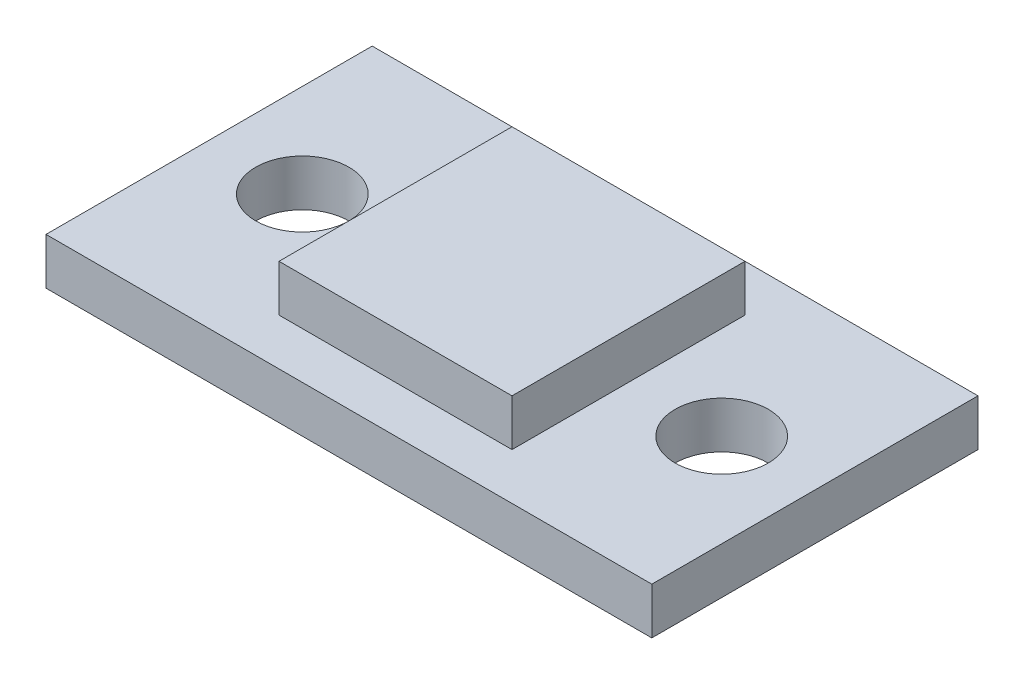
ISO-10303-21;
HEADER;
FILE_DESCRIPTION(('STEP AP214'),'2;1');
FILE_NAME('part.step','',(''),(''),'','','');
FILE_SCHEMA(('AUTOMOTIVE_DESIGN { 1 0 10303 214 1 1 1 1 }'));
ENDSEC;
DATA;
#1=APPLICATION_CONTEXT('core data for automotive mechanical design processes');
#2=APPLICATION_PROTOCOL_DEFINITION('international standard','automotive_design',2000,#1);
#3=PRODUCT_CONTEXT('',#1,'mechanical');
#4=PRODUCT('Part','Part','',(#3));
#5=PRODUCT_RELATED_PRODUCT_CATEGORY('part','',(#4));
#6=PRODUCT_DEFINITION_FORMATION('','',#4);
#7=PRODUCT_DEFINITION_CONTEXT('part definition',#1,'design');
#8=PRODUCT_DEFINITION('design','',#6,#7);
#9=PRODUCT_DEFINITION_SHAPE('','',#8);
#10=(LENGTH_UNIT() NAMED_UNIT(*) SI_UNIT(.MILLI.,.METRE.));
#11=(NAMED_UNIT(*) PLANE_ANGLE_UNIT() SI_UNIT($,.RADIAN.));
#12=(NAMED_UNIT(*) SI_UNIT($,.STERADIAN.) SOLID_ANGLE_UNIT());
#13=UNCERTAINTY_MEASURE_WITH_UNIT(LENGTH_MEASURE(1.E-05),#10,'distance_accuracy_value','');
#14=(GEOMETRIC_REPRESENTATION_CONTEXT(3) GLOBAL_UNCERTAINTY_ASSIGNED_CONTEXT((#13)) GLOBAL_UNIT_ASSIGNED_CONTEXT((#10,
#11,#12)) REPRESENTATION_CONTEXT('',''));
#15=CARTESIAN_POINT('',(0.,0.,0.));
#16=DIRECTION('',(0.,0.,1.));
#17=DIRECTION('',(1.,0.,0.));
#18=AXIS2_PLACEMENT_3D('',#15,#16,#17);
#19=CARTESIAN_POINT('',(-2.5,1.,-2.5));
#20=DIRECTION('',(1.,0.,0.));
#21=DIRECTION('',(0.,0.,-1.));
#22=AXIS2_PLACEMENT_3D('',#19,#20,#21);
#23=PLANE('',#22);
#24=DIRECTION('',(0.,0.,1.));
#25=VECTOR('',#24,1.);
#26=CARTESIAN_POINT('',(-2.5,0.,-2.5));
#27=LINE('',#26,#25);
#28=CARTESIAN_POINT('',(-2.5,0.,-2.5));
#29=VERTEX_POINT('',#28);
#30=CARTESIAN_POINT('',(-2.5,0.,2.5));
#31=VERTEX_POINT('',#30);
#32=EDGE_CURVE('E119',#29,#31,#27,.T.);
#33=ORIENTED_EDGE('',*,*,#32,.T.);
#34=DIRECTION('',(0.,-1.,0.));
#35=VECTOR('',#34,1.);
#36=CARTESIAN_POINT('',(-2.5,1.,2.5));
#37=LINE('',#36,#35);
#38=CARTESIAN_POINT('',(-2.5,1.,2.5));
#39=VERTEX_POINT('',#38);
#40=EDGE_CURVE('E11',#39,#31,#37,.T.);
#41=ORIENTED_EDGE('',*,*,#40,.F.);
#42=DIRECTION('',(0.,0.,1.));
#43=VECTOR('',#42,1.);
#44=CARTESIAN_POINT('',(-2.5,1.,-2.5));
#45=LINE('',#44,#43);
#46=CARTESIAN_POINT('',(-2.5,1.,-2.5));
#47=VERTEX_POINT('',#46);
#48=EDGE_CURVE('E128',#47,#39,#45,.T.);
#49=ORIENTED_EDGE('',*,*,#48,.F.);
#50=DIRECTION('',(0.,-1.,0.));
#51=VECTOR('',#50,1.);
#52=CARTESIAN_POINT('',(-2.5,1.,-2.5));
#53=LINE('',#52,#51);
#54=EDGE_CURVE('E135',#47,#29,#53,.T.);
#55=ORIENTED_EDGE('',*,*,#54,.T.);
#56=EDGE_LOOP('',(#33,#41,#49,#55));
#57=FACE_BOUND('',#56,.T.);
#58=ADVANCED_FACE('F33',(#57),#23,.F.);
#59=CARTESIAN_POINT('',(-2.5,1.,2.5));
#60=DIRECTION('',(0.,0.,-1.));
#61=DIRECTION('',(-1.,0.,0.));
#62=AXIS2_PLACEMENT_3D('',#59,#60,#61);
#63=PLANE('',#62);
#64=DIRECTION('',(1.,0.,0.));
#65=VECTOR('',#64,1.);
#66=CARTESIAN_POINT('',(-2.5,0.,2.5));
#67=LINE('',#66,#65);
#68=CARTESIAN_POINT('',(2.5,0.,2.5));
#69=VERTEX_POINT('',#68);
#70=EDGE_CURVE('E122',#31,#69,#67,.T.);
#71=ORIENTED_EDGE('',*,*,#70,.T.);
#72=DIRECTION('',(0.,-1.,0.));
#73=VECTOR('',#72,1.);
#74=CARTESIAN_POINT('',(2.5,1.,2.5));
#75=LINE('',#74,#73);
#76=CARTESIAN_POINT('',(2.5,1.,2.5));
#77=VERTEX_POINT('',#76);
#78=EDGE_CURVE('E41',#77,#69,#75,.T.);
#79=ORIENTED_EDGE('',*,*,#78,.F.);
#80=DIRECTION('',(1.,0.,0.));
#81=VECTOR('',#80,1.);
#82=CARTESIAN_POINT('',(-2.5,1.,2.5));
#83=LINE('',#82,#81);
#84=EDGE_CURVE('E130',#39,#77,#83,.T.);
#85=ORIENTED_EDGE('',*,*,#84,.F.);
#86=ORIENTED_EDGE('',*,*,#40,.T.);
#87=EDGE_LOOP('',(#71,#79,#85,#86));
#88=FACE_BOUND('',#87,.T.);
#89=ADVANCED_FACE('F155',(#88),#63,.F.);
#90=CARTESIAN_POINT('',(2.5,1.,-2.5));
#91=DIRECTION('',(-1.,0.,0.));
#92=DIRECTION('',(0.,0.,1.));
#93=AXIS2_PLACEMENT_3D('',#90,#91,#92);
#94=PLANE('',#93);
#95=DIRECTION('',(0.,0.,-1.));
#96=VECTOR('',#95,1.);
#97=CARTESIAN_POINT('',(2.5,0.,-2.5));
#98=LINE('',#97,#96);
#99=CARTESIAN_POINT('',(2.5,0.,-2.5));
#100=VERTEX_POINT('',#99);
#101=EDGE_CURVE('E139',#69,#100,#98,.T.);
#102=ORIENTED_EDGE('',*,*,#101,.T.);
#103=DIRECTION('',(0.,-1.,0.));
#104=VECTOR('',#103,1.);
#105=CARTESIAN_POINT('',(2.5,1.,-2.5));
#106=LINE('',#105,#104);
#107=CARTESIAN_POINT('',(2.5,1.,-2.5));
#108=VERTEX_POINT('',#107);
#109=EDGE_CURVE('E146',#108,#100,#106,.T.);
#110=ORIENTED_EDGE('',*,*,#109,.F.);
#111=DIRECTION('',(0.,0.,-1.));
#112=VECTOR('',#111,1.);
#113=CARTESIAN_POINT('',(2.5,1.,-2.5));
#114=LINE('',#113,#112);
#115=EDGE_CURVE('E133',#77,#108,#114,.T.);
#116=ORIENTED_EDGE('',*,*,#115,.F.);
#117=ORIENTED_EDGE('',*,*,#78,.T.);
#118=EDGE_LOOP('',(#102,#110,#116,#117));
#119=FACE_BOUND('',#118,.T.);
#120=ADVANCED_FACE('F152',(#119),#94,.F.);
#121=CARTESIAN_POINT('',(-2.5,1.,-2.5));
#122=DIRECTION('',(0.,0.,1.));
#123=DIRECTION('',(1.,0.,0.));
#124=AXIS2_PLACEMENT_3D('',#121,#122,#123);
#125=PLANE('',#124);
#126=DIRECTION('',(-1.,0.,0.));
#127=VECTOR('',#126,1.);
#128=CARTESIAN_POINT('',(-2.5,0.,-2.5));
#129=LINE('',#128,#127);
#130=EDGE_CURVE('E131',#100,#29,#129,.T.);
#131=ORIENTED_EDGE('',*,*,#130,.T.);
#132=ORIENTED_EDGE('',*,*,#54,.F.);
#133=DIRECTION('',(-1.,0.,0.));
#134=VECTOR('',#133,1.);
#135=CARTESIAN_POINT('',(-2.5,1.,-2.5));
#136=LINE('',#135,#134);
#137=EDGE_CURVE('E48',#108,#47,#136,.T.);
#138=ORIENTED_EDGE('',*,*,#137,.F.);
#139=ORIENTED_EDGE('',*,*,#109,.T.);
#140=EDGE_LOOP('',(#131,#132,#138,#139));
#141=FACE_BOUND('',#140,.T.);
#142=ADVANCED_FACE('F161',(#141),#125,.F.);
#143=CARTESIAN_POINT('',(0.,1.,0.));
#144=DIRECTION('',(0.,1.,0.));
#145=DIRECTION('',(0.,0.,1.));
#146=AXIS2_PLACEMENT_3D('',#143,#144,#145);
#147=PLANE('',#146);
#148=ORIENTED_EDGE('',*,*,#48,.T.);
#149=ORIENTED_EDGE('',*,*,#84,.T.);
#150=ORIENTED_EDGE('',*,*,#115,.T.);
#151=ORIENTED_EDGE('',*,*,#137,.T.);
#152=EDGE_LOOP('',(#148,#149,#150,#151));
#153=FACE_BOUND('',#152,.T.);
#154=ADVANCED_FACE('F164',(#153),#147,.T.);
#155=CARTESIAN_POINT('',(0.,0.,0.));
#156=DIRECTION('',(0.,-1.,0.));
#157=DIRECTION('',(0.,0.,-1.));
#158=AXIS2_PLACEMENT_3D('',#155,#156,#157);
#159=PLANE('',#158);
#160=CARTESIAN_POINT('',(-4.5,0.,0.));
#161=DIRECTION('',(0.,-1.,0.));
#162=DIRECTION('',(0.,0.,1.));
#163=AXIS2_PLACEMENT_3D('',#160,#161,#162);
#164=CIRCLE('',#163,1.);
#165=CARTESIAN_POINT('',(-4.5,0.,1.));
#166=VERTEX_POINT('',#165);
#167=EDGE_CURVE('E270',#166,#166,#164,.T.);
#168=ORIENTED_EDGE('',*,*,#167,.T.);
#169=EDGE_LOOP('',(#168));
#170=FACE_BOUND('',#169,.T.);
#171=DIRECTION('',(0.,0.,-1.));
#172=VECTOR('',#171,1.);
#173=CARTESIAN_POINT('',(-6.5,0.,3.5));
#174=LINE('',#173,#172);
#175=CARTESIAN_POINT('',(-6.5,0.,3.5));
#176=VERTEX_POINT('',#175);
#177=CARTESIAN_POINT('',(-6.5,0.,-3.5));
#178=VERTEX_POINT('',#177);
#179=EDGE_CURVE('E118',#176,#178,#174,.T.);
#180=ORIENTED_EDGE('',*,*,#179,.F.);
#181=DIRECTION('',(-1.,0.,0.));
#182=VECTOR('',#181,1.);
#183=CARTESIAN_POINT('',(-6.5,0.,3.5));
#184=LINE('',#183,#182);
#185=CARTESIAN_POINT('',(6.5,0.,3.5));
#186=VERTEX_POINT('',#185);
#187=EDGE_CURVE('E114',#186,#176,#184,.T.);
#188=ORIENTED_EDGE('',*,*,#187,.F.);
#189=DIRECTION('',(0.,0.,1.));
#190=VECTOR('',#189,1.);
#191=CARTESIAN_POINT('',(6.5,0.,3.5));
#192=LINE('',#191,#190);
#193=CARTESIAN_POINT('',(6.5,0.,-3.5));
#194=VERTEX_POINT('',#193);
#195=EDGE_CURVE('E286',#194,#186,#192,.T.);
#196=ORIENTED_EDGE('',*,*,#195,.F.);
#197=DIRECTION('',(1.,0.,0.));
#198=VECTOR('',#197,1.);
#199=CARTESIAN_POINT('',(-6.5,0.,-3.5));
#200=LINE('',#199,#198);
#201=EDGE_CURVE('E284',#178,#194,#200,.T.);
#202=ORIENTED_EDGE('',*,*,#201,.F.);
#203=EDGE_LOOP('',(#180,#188,#196,#202));
#204=FACE_BOUND('',#203,.T.);
#205=CARTESIAN_POINT('',(4.5,0.,0.));
#206=DIRECTION('',(0.,-1.,0.));
#207=DIRECTION('',(0.,0.,-1.));
#208=AXIS2_PLACEMENT_3D('',#205,#206,#207);
#209=CIRCLE('',#208,1.);
#210=CARTESIAN_POINT('',(4.5,0.,-1.));
#211=VERTEX_POINT('',#210);
#212=EDGE_CURVE('E272',#211,#211,#209,.T.);
#213=ORIENTED_EDGE('',*,*,#212,.T.);
#214=EDGE_LOOP('',(#213));
#215=FACE_BOUND('',#214,.T.);
#216=ORIENTED_EDGE('',*,*,#70,.F.);
#217=ORIENTED_EDGE('',*,*,#32,.F.);
#218=ORIENTED_EDGE('',*,*,#130,.F.);
#219=ORIENTED_EDGE('',*,*,#101,.F.);
#220=EDGE_LOOP('',(#216,#217,#218,#219));
#221=FACE_BOUND('',#220,.T.);
#222=ADVANCED_FACE('F159',(#170,#204,#215,#221),#159,.F.);
#223=CARTESIAN_POINT('',(0.,-1.,0.));
#224=DIRECTION('',(0.,-1.,0.));
#225=DIRECTION('',(0.,0.,-1.));
#226=AXIS2_PLACEMENT_3D('',#223,#224,#225);
#227=PLANE('',#226);
#228=CARTESIAN_POINT('',(4.5,-1.,0.));
#229=DIRECTION('',(0.,-1.,0.));
#230=DIRECTION('',(0.,0.,-1.));
#231=AXIS2_PLACEMENT_3D('',#228,#229,#230);
#232=CIRCLE('',#231,1.);
#233=CARTESIAN_POINT('',(4.5,-1.,-1.));
#234=VERTEX_POINT('',#233);
#235=EDGE_CURVE('E275',#234,#234,#232,.T.);
#236=ORIENTED_EDGE('',*,*,#235,.F.);
#237=EDGE_LOOP('',(#236));
#238=FACE_BOUND('',#237,.T.);
#239=DIRECTION('',(0.,0.,-1.));
#240=VECTOR('',#239,1.);
#241=CARTESIAN_POINT('',(-6.5,-1.,3.5));
#242=LINE('',#241,#240);
#243=CARTESIAN_POINT('',(-6.5,-1.,3.5));
#244=VERTEX_POINT('',#243);
#245=CARTESIAN_POINT('',(-6.5,-1.,-3.5));
#246=VERTEX_POINT('',#245);
#247=EDGE_CURVE('E104',#244,#246,#242,.T.);
#248=ORIENTED_EDGE('',*,*,#247,.T.);
#249=DIRECTION('',(1.,0.,0.));
#250=VECTOR('',#249,1.);
#251=CARTESIAN_POINT('',(-6.5,-1.,-3.5));
#252=LINE('',#251,#250);
#253=CARTESIAN_POINT('',(6.5,-1.,-3.5));
#254=VERTEX_POINT('',#253);
#255=EDGE_CURVE('E93',#246,#254,#252,.T.);
#256=ORIENTED_EDGE('',*,*,#255,.T.);
#257=DIRECTION('',(0.,0.,1.));
#258=VECTOR('',#257,1.);
#259=CARTESIAN_POINT('',(6.5,-1.,3.5));
#260=LINE('',#259,#258);
#261=CARTESIAN_POINT('',(6.5,-1.,3.5));
#262=VERTEX_POINT('',#261);
#263=EDGE_CURVE('E103',#254,#262,#260,.T.);
#264=ORIENTED_EDGE('',*,*,#263,.T.);
#265=DIRECTION('',(-1.,0.,0.));
#266=VECTOR('',#265,1.);
#267=CARTESIAN_POINT('',(-6.5,-1.,3.5));
#268=LINE('',#267,#266);
#269=EDGE_CURVE('E110',#262,#244,#268,.T.);
#270=ORIENTED_EDGE('',*,*,#269,.T.);
#271=EDGE_LOOP('',(#248,#256,#264,#270));
#272=FACE_BOUND('',#271,.T.);
#273=CARTESIAN_POINT('',(-4.5,-1.,0.));
#274=DIRECTION('',(0.,-1.,0.));
#275=DIRECTION('',(0.,0.,1.));
#276=AXIS2_PLACEMENT_3D('',#273,#274,#275);
#277=CIRCLE('',#276,1.);
#278=CARTESIAN_POINT('',(-4.5,-1.,1.));
#279=VERTEX_POINT('',#278);
#280=EDGE_CURVE('E267',#279,#279,#277,.T.);
#281=ORIENTED_EDGE('',*,*,#280,.F.);
#282=EDGE_LOOP('',(#281));
#283=FACE_BOUND('',#282,.T.);
#284=ADVANCED_FACE('F107',(#238,#272,#283),#227,.T.);
#285=CARTESIAN_POINT('',(-6.5,-1.,3.5));
#286=DIRECTION('',(1.,0.,0.));
#287=DIRECTION('',(0.,0.,-1.));
#288=AXIS2_PLACEMENT_3D('',#285,#286,#287);
#289=PLANE('',#288);
#290=ORIENTED_EDGE('',*,*,#179,.T.);
#291=DIRECTION('',(0.,1.,0.));
#292=VECTOR('',#291,1.);
#293=CARTESIAN_POINT('',(-6.5,-1.,-3.5));
#294=LINE('',#293,#292);
#295=EDGE_CURVE('E97',#246,#178,#294,.T.);
#296=ORIENTED_EDGE('',*,*,#295,.F.);
#297=ORIENTED_EDGE('',*,*,#247,.F.);
#298=DIRECTION('',(0.,1.,0.));
#299=VECTOR('',#298,1.);
#300=CARTESIAN_POINT('',(-6.5,-1.,3.5));
#301=LINE('',#300,#299);
#302=EDGE_CURVE('E282',#244,#176,#301,.T.);
#303=ORIENTED_EDGE('',*,*,#302,.T.);
#304=EDGE_LOOP('',(#290,#296,#297,#303));
#305=FACE_BOUND('',#304,.T.);
#306=ADVANCED_FACE('F116',(#305),#289,.F.);
#307=CARTESIAN_POINT('',(-6.5,-1.,-3.5));
#308=DIRECTION('',(0.,0.,1.));
#309=DIRECTION('',(1.,0.,0.));
#310=AXIS2_PLACEMENT_3D('',#307,#308,#309);
#311=PLANE('',#310);
#312=ORIENTED_EDGE('',*,*,#201,.T.);
#313=DIRECTION('',(0.,1.,0.));
#314=VECTOR('',#313,1.);
#315=CARTESIAN_POINT('',(6.5,-1.,-3.5));
#316=LINE('',#315,#314);
#317=EDGE_CURVE('E100',#254,#194,#316,.T.);
#318=ORIENTED_EDGE('',*,*,#317,.F.);
#319=ORIENTED_EDGE('',*,*,#255,.F.);
#320=ORIENTED_EDGE('',*,*,#295,.T.);
#321=EDGE_LOOP('',(#312,#318,#319,#320));
#322=FACE_BOUND('',#321,.T.);
#323=ADVANCED_FACE('F95',(#322),#311,.F.);
#324=CARTESIAN_POINT('',(6.5,-1.,3.5));
#325=DIRECTION('',(-1.,0.,0.));
#326=DIRECTION('',(0.,0.,1.));
#327=AXIS2_PLACEMENT_3D('',#324,#325,#326);
#328=PLANE('',#327);
#329=ORIENTED_EDGE('',*,*,#195,.T.);
#330=DIRECTION('',(0.,1.,0.));
#331=VECTOR('',#330,1.);
#332=CARTESIAN_POINT('',(6.5,-1.,3.5));
#333=LINE('',#332,#331);
#334=EDGE_CURVE('E124',#262,#186,#333,.T.);
#335=ORIENTED_EDGE('',*,*,#334,.F.);
#336=ORIENTED_EDGE('',*,*,#263,.F.);
#337=ORIENTED_EDGE('',*,*,#317,.T.);
#338=EDGE_LOOP('',(#329,#335,#336,#337));
#339=FACE_BOUND('',#338,.T.);
#340=ADVANCED_FACE('F221',(#339),#328,.F.);
#341=CARTESIAN_POINT('',(-6.5,-1.,3.5));
#342=DIRECTION('',(0.,0.,-1.));
#343=DIRECTION('',(-1.,0.,0.));
#344=AXIS2_PLACEMENT_3D('',#341,#342,#343);
#345=PLANE('',#344);
#346=ORIENTED_EDGE('',*,*,#187,.T.);
#347=ORIENTED_EDGE('',*,*,#302,.F.);
#348=ORIENTED_EDGE('',*,*,#269,.F.);
#349=ORIENTED_EDGE('',*,*,#334,.T.);
#350=EDGE_LOOP('',(#346,#347,#348,#349));
#351=FACE_BOUND('',#350,.T.);
#352=ADVANCED_FACE('F230',(#351),#345,.F.);
#353=CARTESIAN_POINT('',(4.5,-1.,0.));
#354=DIRECTION('',(0.,1.,0.));
#355=DIRECTION('',(0.,0.,1.));
#356=AXIS2_PLACEMENT_3D('',#353,#354,#355);
#357=CYLINDRICAL_SURFACE('',#356,1.);
#358=ORIENTED_EDGE('',*,*,#235,.T.);
#359=EDGE_LOOP('',(#358));
#360=FACE_BOUND('',#359,.T.);
#361=ORIENTED_EDGE('',*,*,#212,.F.);
#362=EDGE_LOOP('',(#361));
#363=FACE_BOUND('',#362,.T.);
#364=ADVANCED_FACE('F240',(#360,#363),#357,.F.);
#365=CARTESIAN_POINT('',(-4.5,-1.,0.));
#366=DIRECTION('',(0.,1.,0.));
#367=DIRECTION('',(0.,0.,1.));
#368=AXIS2_PLACEMENT_3D('',#365,#366,#367);
#369=CYLINDRICAL_SURFACE('',#368,1.);
#370=ORIENTED_EDGE('',*,*,#280,.T.);
#371=EDGE_LOOP('',(#370));
#372=FACE_BOUND('',#371,.T.);
#373=ORIENTED_EDGE('',*,*,#167,.F.);
#374=EDGE_LOOP('',(#373));
#375=FACE_BOUND('',#374,.T.);
#376=ADVANCED_FACE('F250',(#372,#375),#369,.F.);
#377=CLOSED_SHELL('',(#58,#89,#120,#142,#154,#222,#284,#306,#323,#340,#352,#364,#376));
#378=MANIFOLD_SOLID_BREP('B2',#377);
#379=ADVANCED_BREP_SHAPE_REPRESENTATION('',(#18,#378),#14);
#380=SHAPE_DEFINITION_REPRESENTATION(#9,#379);
ENDSEC;
END-ISO-10303-21;
